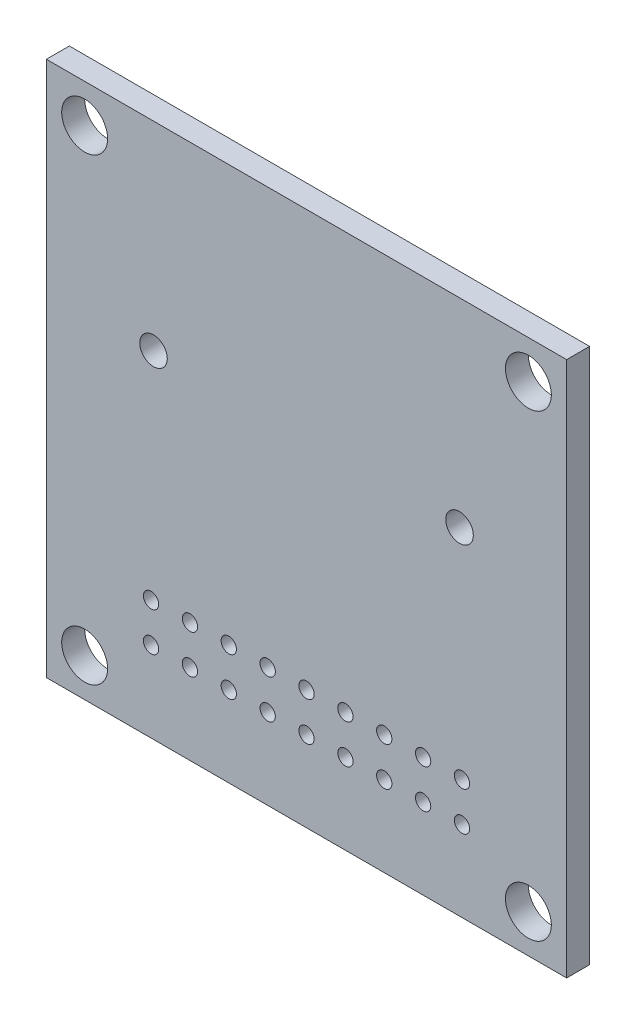
ISO-10303-21;
HEADER;
FILE_DESCRIPTION(('STEP AP214'),'2;1');
FILE_NAME('part.step','',(''),(''),'','','');
FILE_SCHEMA(('AUTOMOTIVE_DESIGN { 1 0 10303 214 1 1 1 1 }'));
ENDSEC;
DATA;
#1=APPLICATION_CONTEXT('core data for automotive mechanical design processes');
#2=APPLICATION_PROTOCOL_DEFINITION('international standard','automotive_design',2000,#1);
#3=PRODUCT_CONTEXT('',#1,'mechanical');
#4=PRODUCT('Part','Part','',(#3));
#5=PRODUCT_RELATED_PRODUCT_CATEGORY('part','',(#4));
#6=PRODUCT_DEFINITION_FORMATION('','',#4);
#7=PRODUCT_DEFINITION_CONTEXT('part definition',#1,'design');
#8=PRODUCT_DEFINITION('design','',#6,#7);
#9=PRODUCT_DEFINITION_SHAPE('','',#8);
#10=(LENGTH_UNIT() NAMED_UNIT(*) SI_UNIT(.MILLI.,.METRE.));
#11=(NAMED_UNIT(*) PLANE_ANGLE_UNIT() SI_UNIT($,.RADIAN.));
#12=(NAMED_UNIT(*) SI_UNIT($,.STERADIAN.) SOLID_ANGLE_UNIT());
#13=UNCERTAINTY_MEASURE_WITH_UNIT(LENGTH_MEASURE(1.E-05),#10,'distance_accuracy_value','');
#14=(GEOMETRIC_REPRESENTATION_CONTEXT(3) GLOBAL_UNCERTAINTY_ASSIGNED_CONTEXT((#13)) GLOBAL_UNIT_ASSIGNED_CONTEXT((#10,
#11,#12)) REPRESENTATION_CONTEXT('',''));
#15=CARTESIAN_POINT('',(0.,0.,0.));
#16=DIRECTION('',(0.,0.,1.));
#17=DIRECTION('',(1.,0.,0.));
#18=AXIS2_PLACEMENT_3D('',#15,#16,#17);
#19=CARTESIAN_POINT('',(0.,0.,1.5));
#20=DIRECTION('',(0.,0.,1.));
#21=DIRECTION('',(1.,0.,0.));
#22=AXIS2_PLACEMENT_3D('',#19,#20,#21);
#23=PLANE('',#22);
#24=CARTESIAN_POINT('',(-7.62,-9.69000000000001,1.5));
#25=DIRECTION('',(0.,0.,1.));
#26=DIRECTION('',(1.,0.,0.));
#27=AXIS2_PLACEMENT_3D('',#24,#25,#26);
#28=CIRCLE('',#27,0.500000000000001);
#29=CARTESIAN_POINT('',(-7.12,-9.69000000000001,1.5));
#30=VERTEX_POINT('',#29);
#31=EDGE_CURVE('E142',#30,#30,#28,.T.);
#32=ORIENTED_EDGE('',*,*,#31,.F.);
#33=EDGE_LOOP('',(#32));
#34=FACE_BOUND('',#33,.T.);
#35=CARTESIAN_POINT('',(-5.08,-12.23,1.5));
#36=DIRECTION('',(0.,0.,1.));
#37=DIRECTION('',(1.,0.,0.));
#38=AXIS2_PLACEMENT_3D('',#35,#36,#37);
#39=CIRCLE('',#38,0.500000000000002);
#40=CARTESIAN_POINT('',(-4.58,-12.23,1.5));
#41=VERTEX_POINT('',#40);
#42=EDGE_CURVE('E145',#41,#41,#39,.T.);
#43=ORIENTED_EDGE('',*,*,#42,.F.);
#44=EDGE_LOOP('',(#43));
#45=FACE_BOUND('',#44,.T.);
#46=CARTESIAN_POINT('',(-5.08,-9.69000000000001,1.5));
#47=DIRECTION('',(0.,0.,1.));
#48=DIRECTION('',(1.,0.,0.));
#49=AXIS2_PLACEMENT_3D('',#46,#47,#48);
#50=CIRCLE('',#49,0.500000000000002);
#51=CARTESIAN_POINT('',(-4.58,-9.69000000000001,1.5));
#52=VERTEX_POINT('',#51);
#53=EDGE_CURVE('E148',#52,#52,#50,.T.);
#54=ORIENTED_EDGE('',*,*,#53,.F.);
#55=EDGE_LOOP('',(#54));
#56=FACE_BOUND('',#55,.T.);
#57=CARTESIAN_POINT('',(-2.54,-12.23,1.5));
#58=DIRECTION('',(0.,0.,1.));
#59=DIRECTION('',(1.,0.,0.));
#60=AXIS2_PLACEMENT_3D('',#57,#58,#59);
#61=CIRCLE('',#60,0.500000000000001);
#62=CARTESIAN_POINT('',(-2.04,-12.23,1.5));
#63=VERTEX_POINT('',#62);
#64=EDGE_CURVE('E151',#63,#63,#61,.T.);
#65=ORIENTED_EDGE('',*,*,#64,.F.);
#66=EDGE_LOOP('',(#65));
#67=FACE_BOUND('',#66,.T.);
#68=CARTESIAN_POINT('',(-2.54,-9.69000000000001,1.5));
#69=DIRECTION('',(0.,0.,1.));
#70=DIRECTION('',(1.,0.,0.));
#71=AXIS2_PLACEMENT_3D('',#68,#69,#70);
#72=CIRCLE('',#71,0.500000000000001);
#73=CARTESIAN_POINT('',(-2.04,-9.69000000000001,1.5));
#74=VERTEX_POINT('',#73);
#75=EDGE_CURVE('E154',#74,#74,#72,.T.);
#76=ORIENTED_EDGE('',*,*,#75,.F.);
#77=EDGE_LOOP('',(#76));
#78=FACE_BOUND('',#77,.T.);
#79=CARTESIAN_POINT('',(-10.,4.5,1.5));
#80=DIRECTION('',(0.,0.,1.));
#81=DIRECTION('',(1.,0.,0.));
#82=AXIS2_PLACEMENT_3D('',#79,#80,#81);
#83=CIRCLE('',#82,0.9);
#84=CARTESIAN_POINT('',(-9.1,4.5,1.5));
#85=VERTEX_POINT('',#84);
#86=EDGE_CURVE('E157',#85,#85,#83,.T.);
#87=ORIENTED_EDGE('',*,*,#86,.F.);
#88=EDGE_LOOP('',(#87));
#89=FACE_BOUND('',#88,.T.);
#90=CARTESIAN_POINT('',(-10.16,-12.23,1.5));
#91=DIRECTION('',(0.,0.,1.));
#92=DIRECTION('',(1.,0.,0.));
#93=AXIS2_PLACEMENT_3D('',#90,#91,#92);
#94=CIRCLE('',#93,0.500000000000001);
#95=CARTESIAN_POINT('',(-9.66,-12.23,1.5));
#96=VERTEX_POINT('',#95);
#97=EDGE_CURVE('E160',#96,#96,#94,.T.);
#98=ORIENTED_EDGE('',*,*,#97,.F.);
#99=EDGE_LOOP('',(#98));
#100=FACE_BOUND('',#99,.T.);
#101=CARTESIAN_POINT('',(-10.16,-9.69000000000001,1.5));
#102=DIRECTION('',(0.,0.,1.));
#103=DIRECTION('',(1.,0.,0.));
#104=AXIS2_PLACEMENT_3D('',#101,#102,#103);
#105=CIRCLE('',#104,0.500000000000001);
#106=CARTESIAN_POINT('',(-9.66,-9.69000000000001,1.5));
#107=VERTEX_POINT('',#106);
#108=EDGE_CURVE('E163',#107,#107,#105,.T.);
#109=ORIENTED_EDGE('',*,*,#108,.F.);
#110=EDGE_LOOP('',(#109));
#111=FACE_BOUND('',#110,.T.);
#112=CARTESIAN_POINT('',(-7.62,-12.23,1.5));
#113=DIRECTION('',(0.,0.,1.));
#114=DIRECTION('',(1.,0.,0.));
#115=AXIS2_PLACEMENT_3D('',#112,#113,#114);
#116=CIRCLE('',#115,0.500000000000001);
#117=CARTESIAN_POINT('',(-7.12,-12.23,1.5));
#118=VERTEX_POINT('',#117);
#119=EDGE_CURVE('E166',#118,#118,#116,.T.);
#120=ORIENTED_EDGE('',*,*,#119,.F.);
#121=EDGE_LOOP('',(#120));
#122=FACE_BOUND('',#121,.T.);
#123=CARTESIAN_POINT('',(5.08,-9.69000000000001,1.5));
#124=DIRECTION('',(0.,0.,1.));
#125=DIRECTION('',(1.,0.,0.));
#126=AXIS2_PLACEMENT_3D('',#123,#124,#125);
#127=CIRCLE('',#126,0.500000000000001);
#128=CARTESIAN_POINT('',(5.58,-9.69000000000001,1.5));
#129=VERTEX_POINT('',#128);
#130=EDGE_CURVE('E169',#129,#129,#127,.T.);
#131=ORIENTED_EDGE('',*,*,#130,.F.);
#132=EDGE_LOOP('',(#131));
#133=FACE_BOUND('',#132,.T.);
#134=CARTESIAN_POINT('',(7.62,-12.23,1.5));
#135=DIRECTION('',(0.,0.,1.));
#136=DIRECTION('',(1.,0.,0.));
#137=AXIS2_PLACEMENT_3D('',#134,#135,#136);
#138=CIRCLE('',#137,0.500000000000001);
#139=CARTESIAN_POINT('',(8.12,-12.23,1.5));
#140=VERTEX_POINT('',#139);
#141=EDGE_CURVE('E172',#140,#140,#138,.T.);
#142=ORIENTED_EDGE('',*,*,#141,.F.);
#143=EDGE_LOOP('',(#142));
#144=FACE_BOUND('',#143,.T.);
#145=CARTESIAN_POINT('',(7.62,-9.69000000000001,1.5));
#146=DIRECTION('',(0.,0.,1.));
#147=DIRECTION('',(1.,0.,0.));
#148=AXIS2_PLACEMENT_3D('',#145,#146,#147);
#149=CIRCLE('',#148,0.500000000000001);
#150=CARTESIAN_POINT('',(8.12,-9.69000000000001,1.5));
#151=VERTEX_POINT('',#150);
#152=EDGE_CURVE('E175',#151,#151,#149,.T.);
#153=ORIENTED_EDGE('',*,*,#152,.F.);
#154=EDGE_LOOP('',(#153));
#155=FACE_BOUND('',#154,.T.);
#156=CARTESIAN_POINT('',(10.16,-12.23,1.5));
#157=DIRECTION('',(0.,0.,1.));
#158=DIRECTION('',(1.,0.,0.));
#159=AXIS2_PLACEMENT_3D('',#156,#157,#158);
#160=CIRCLE('',#159,0.500000000000001);
#161=CARTESIAN_POINT('',(10.66,-12.23,1.5));
#162=VERTEX_POINT('',#161);
#163=EDGE_CURVE('E178',#162,#162,#160,.T.);
#164=ORIENTED_EDGE('',*,*,#163,.F.);
#165=EDGE_LOOP('',(#164));
#166=FACE_BOUND('',#165,.T.);
#167=CARTESIAN_POINT('',(10.16,-9.69000000000001,1.5));
#168=DIRECTION('',(0.,0.,1.));
#169=DIRECTION('',(1.,0.,0.));
#170=AXIS2_PLACEMENT_3D('',#167,#168,#169);
#171=CIRCLE('',#170,0.500000000000001);
#172=CARTESIAN_POINT('',(10.66,-9.69000000000001,1.5));
#173=VERTEX_POINT('',#172);
#174=EDGE_CURVE('E181',#173,#173,#171,.T.);
#175=ORIENTED_EDGE('',*,*,#174,.F.);
#176=EDGE_LOOP('',(#175));
#177=FACE_BOUND('',#176,.T.);
#178=CARTESIAN_POINT('',(2.54,-12.23,1.5));
#179=DIRECTION('',(0.,0.,1.));
#180=DIRECTION('',(1.,0.,0.));
#181=AXIS2_PLACEMENT_3D('',#178,#179,#180);
#182=CIRCLE('',#181,0.500000000000001);
#183=CARTESIAN_POINT('',(3.04,-12.23,1.5));
#184=VERTEX_POINT('',#183);
#185=EDGE_CURVE('E184',#184,#184,#182,.T.);
#186=ORIENTED_EDGE('',*,*,#185,.F.);
#187=EDGE_LOOP('',(#186));
#188=FACE_BOUND('',#187,.T.);
#189=CARTESIAN_POINT('',(2.54,-9.69000000000001,1.5));
#190=DIRECTION('',(0.,0.,1.));
#191=DIRECTION('',(1.,0.,0.));
#192=AXIS2_PLACEMENT_3D('',#189,#190,#191);
#193=CIRCLE('',#192,0.500000000000001);
#194=CARTESIAN_POINT('',(3.04,-9.69000000000001,1.5));
#195=VERTEX_POINT('',#194);
#196=EDGE_CURVE('E187',#195,#195,#193,.T.);
#197=ORIENTED_EDGE('',*,*,#196,.F.);
#198=EDGE_LOOP('',(#197));
#199=FACE_BOUND('',#198,.T.);
#200=CARTESIAN_POINT('',(5.08,-12.23,1.5));
#201=DIRECTION('',(0.,0.,1.));
#202=DIRECTION('',(1.,0.,0.));
#203=AXIS2_PLACEMENT_3D('',#200,#201,#202);
#204=CIRCLE('',#203,0.500000000000001);
#205=CARTESIAN_POINT('',(5.58,-12.23,1.5));
#206=VERTEX_POINT('',#205);
#207=EDGE_CURVE('E190',#206,#206,#204,.T.);
#208=ORIENTED_EDGE('',*,*,#207,.F.);
#209=EDGE_LOOP('',(#208));
#210=FACE_BOUND('',#209,.T.);
#211=CARTESIAN_POINT('',(0.,-9.69000000000001,1.5));
#212=DIRECTION('',(0.,0.,1.));
#213=DIRECTION('',(1.,0.,0.));
#214=AXIS2_PLACEMENT_3D('',#211,#212,#213);
#215=CIRCLE('',#214,0.500000000000001);
#216=CARTESIAN_POINT('',(0.499999999999998,-9.69000000000001,1.5));
#217=VERTEX_POINT('',#216);
#218=EDGE_CURVE('E193',#217,#217,#215,.T.);
#219=ORIENTED_EDGE('',*,*,#218,.F.);
#220=EDGE_LOOP('',(#219));
#221=FACE_BOUND('',#220,.T.);
#222=CARTESIAN_POINT('',(0.,-12.23,1.5));
#223=DIRECTION('',(0.,0.,1.));
#224=DIRECTION('',(1.,0.,0.));
#225=AXIS2_PLACEMENT_3D('',#222,#223,#224);
#226=CIRCLE('',#225,0.500000000000001);
#227=CARTESIAN_POINT('',(0.499999999999998,-12.23,1.5));
#228=VERTEX_POINT('',#227);
#229=EDGE_CURVE('E196',#228,#228,#226,.T.);
#230=ORIENTED_EDGE('',*,*,#229,.F.);
#231=EDGE_LOOP('',(#230));
#232=FACE_BOUND('',#231,.T.);
#233=CARTESIAN_POINT('',(10.,4.5,1.5));
#234=DIRECTION('',(0.,0.,1.));
#235=DIRECTION('',(1.,0.,0.));
#236=AXIS2_PLACEMENT_3D('',#233,#234,#235);
#237=CIRCLE('',#236,0.9);
#238=CARTESIAN_POINT('',(10.9,4.5,1.5));
#239=VERTEX_POINT('',#238);
#240=EDGE_CURVE('E134',#239,#239,#237,.T.);
#241=ORIENTED_EDGE('',*,*,#240,.F.);
#242=EDGE_LOOP('',(#241));
#243=FACE_BOUND('',#242,.T.);
#244=CARTESIAN_POINT('',(14.5,-15.,1.5));
#245=DIRECTION('',(0.,0.,1.));
#246=DIRECTION('',(1.,0.,0.));
#247=AXIS2_PLACEMENT_3D('',#244,#245,#246);
#248=CIRCLE('',#247,1.5);
#249=CARTESIAN_POINT('',(16.,-15.,1.5));
#250=VERTEX_POINT('',#249);
#251=EDGE_CURVE('E122',#250,#250,#248,.T.);
#252=ORIENTED_EDGE('',*,*,#251,.F.);
#253=EDGE_LOOP('',(#252));
#254=FACE_BOUND('',#253,.T.);
#255=CARTESIAN_POINT('',(-14.5,15.,1.5));
#256=DIRECTION('',(0.,0.,1.));
#257=DIRECTION('',(1.,0.,0.));
#258=AXIS2_PLACEMENT_3D('',#255,#256,#257);
#259=CIRCLE('',#258,1.5);
#260=CARTESIAN_POINT('',(-13.,15.,1.5));
#261=VERTEX_POINT('',#260);
#262=EDGE_CURVE('E101',#261,#261,#259,.T.);
#263=ORIENTED_EDGE('',*,*,#262,.F.);
#264=EDGE_LOOP('',(#263));
#265=FACE_BOUND('',#264,.T.);
#266=DIRECTION('',(0.,-1.,0.));
#267=VECTOR('',#266,1.);
#268=CARTESIAN_POINT('',(-17.,-17.5,1.5));
#269=LINE('',#268,#267);
#270=CARTESIAN_POINT('',(-17.,17.5,1.5));
#271=VERTEX_POINT('',#270);
#272=CARTESIAN_POINT('',(-17.,-17.5,1.5));
#273=VERTEX_POINT('',#272);
#274=EDGE_CURVE('E86',#271,#273,#269,.T.);
#275=ORIENTED_EDGE('',*,*,#274,.T.);
#276=DIRECTION('',(1.,0.,0.));
#277=VECTOR('',#276,1.);
#278=CARTESIAN_POINT('',(17.,-17.5,1.5));
#279=LINE('',#278,#277);
#280=CARTESIAN_POINT('',(17.,-17.5,1.5));
#281=VERTEX_POINT('',#280);
#282=EDGE_CURVE('E81',#273,#281,#279,.T.);
#283=ORIENTED_EDGE('',*,*,#282,.T.);
#284=DIRECTION('',(0.,1.,0.));
#285=VECTOR('',#284,1.);
#286=CARTESIAN_POINT('',(17.,-17.5,1.5));
#287=LINE('',#286,#285);
#288=CARTESIAN_POINT('',(17.,17.5,1.5));
#289=VERTEX_POINT('',#288);
#290=EDGE_CURVE('E84',#281,#289,#287,.T.);
#291=ORIENTED_EDGE('',*,*,#290,.T.);
#292=DIRECTION('',(-1.,0.,0.));
#293=VECTOR('',#292,1.);
#294=CARTESIAN_POINT('',(17.,17.5,1.5));
#295=LINE('',#294,#293);
#296=EDGE_CURVE('E51',#289,#271,#295,.T.);
#297=ORIENTED_EDGE('',*,*,#296,.T.);
#298=EDGE_LOOP('',(#275,#283,#291,#297));
#299=FACE_BOUND('',#298,.T.);
#300=CARTESIAN_POINT('',(-14.5,-15.,1.5));
#301=DIRECTION('',(0.,0.,1.));
#302=DIRECTION('',(1.,0.,0.));
#303=AXIS2_PLACEMENT_3D('',#300,#301,#302);
#304=CIRCLE('',#303,1.5);
#305=CARTESIAN_POINT('',(-13.,-15.,1.5));
#306=VERTEX_POINT('',#305);
#307=EDGE_CURVE('E116',#306,#306,#304,.T.);
#308=ORIENTED_EDGE('',*,*,#307,.F.);
#309=EDGE_LOOP('',(#308));
#310=FACE_BOUND('',#309,.T.);
#311=CARTESIAN_POINT('',(14.5,15.,1.5));
#312=DIRECTION('',(0.,0.,1.));
#313=DIRECTION('',(1.,0.,0.));
#314=AXIS2_PLACEMENT_3D('',#311,#312,#313);
#315=CIRCLE('',#314,1.5);
#316=CARTESIAN_POINT('',(16.,15.,1.5));
#317=VERTEX_POINT('',#316);
#318=EDGE_CURVE('E128',#317,#317,#315,.T.);
#319=ORIENTED_EDGE('',*,*,#318,.F.);
#320=EDGE_LOOP('',(#319));
#321=FACE_BOUND('',#320,.T.);
#322=ADVANCED_FACE('F34',(#34,#45,#56,#67,#78,#89,#100,#111,#122,#133,#144,#155,#166,#177,#188,
#199,#210,#221,#232,#243,#254,#265,#299,#310,#321),#23,.T.);
#323=CARTESIAN_POINT('',(0.,0.,0.));
#324=DIRECTION('',(0.,0.,1.));
#325=DIRECTION('',(1.,0.,0.));
#326=AXIS2_PLACEMENT_3D('',#323,#324,#325);
#327=PLANE('',#326);
#328=CARTESIAN_POINT('',(-7.62,-9.69000000000001,0.));
#329=DIRECTION('',(0.,0.,-1.));
#330=DIRECTION('',(-1.,0.,0.));
#331=AXIS2_PLACEMENT_3D('',#328,#329,#330);
#332=CIRCLE('',#331,0.500000000000001);
#333=CARTESIAN_POINT('',(-8.12,-9.69000000000001,0.));
#334=VERTEX_POINT('',#333);
#335=EDGE_CURVE('E240',#334,#334,#332,.T.);
#336=ORIENTED_EDGE('',*,*,#335,.F.);
#337=EDGE_LOOP('',(#336));
#338=FACE_BOUND('',#337,.T.);
#339=CARTESIAN_POINT('',(-5.08,-12.23,0.));
#340=DIRECTION('',(0.,0.,-1.));
#341=DIRECTION('',(-1.,0.,0.));
#342=AXIS2_PLACEMENT_3D('',#339,#340,#341);
#343=CIRCLE('',#342,0.500000000000002);
#344=CARTESIAN_POINT('',(-5.58000000000001,-12.23,0.));
#345=VERTEX_POINT('',#344);
#346=EDGE_CURVE('E243',#345,#345,#343,.T.);
#347=ORIENTED_EDGE('',*,*,#346,.F.);
#348=EDGE_LOOP('',(#347));
#349=FACE_BOUND('',#348,.T.);
#350=CARTESIAN_POINT('',(-5.08,-9.69000000000001,0.));
#351=DIRECTION('',(0.,0.,-1.));
#352=DIRECTION('',(-1.,0.,0.));
#353=AXIS2_PLACEMENT_3D('',#350,#351,#352);
#354=CIRCLE('',#353,0.500000000000002);
#355=CARTESIAN_POINT('',(-5.58000000000001,-9.69000000000001,0.));
#356=VERTEX_POINT('',#355);
#357=EDGE_CURVE('E246',#356,#356,#354,.T.);
#358=ORIENTED_EDGE('',*,*,#357,.F.);
#359=EDGE_LOOP('',(#358));
#360=FACE_BOUND('',#359,.T.);
#361=CARTESIAN_POINT('',(-2.54,-12.23,0.));
#362=DIRECTION('',(0.,0.,-1.));
#363=DIRECTION('',(-1.,0.,0.));
#364=AXIS2_PLACEMENT_3D('',#361,#362,#363);
#365=CIRCLE('',#364,0.500000000000001);
#366=CARTESIAN_POINT('',(-3.04,-12.23,0.));
#367=VERTEX_POINT('',#366);
#368=EDGE_CURVE('E251',#367,#367,#365,.T.);
#369=ORIENTED_EDGE('',*,*,#368,.F.);
#370=EDGE_LOOP('',(#369));
#371=FACE_BOUND('',#370,.T.);
#372=CARTESIAN_POINT('',(-2.54,-9.69000000000001,0.));
#373=DIRECTION('',(0.,0.,-1.));
#374=DIRECTION('',(-1.,0.,0.));
#375=AXIS2_PLACEMENT_3D('',#372,#373,#374);
#376=CIRCLE('',#375,0.500000000000001);
#377=CARTESIAN_POINT('',(-3.04,-9.69000000000001,0.));
#378=VERTEX_POINT('',#377);
#379=EDGE_CURVE('E216',#378,#378,#376,.T.);
#380=ORIENTED_EDGE('',*,*,#379,.F.);
#381=EDGE_LOOP('',(#380));
#382=FACE_BOUND('',#381,.T.);
#383=CARTESIAN_POINT('',(-10.,4.5,0.));
#384=DIRECTION('',(0.,0.,-1.));
#385=DIRECTION('',(-1.,0.,0.));
#386=AXIS2_PLACEMENT_3D('',#383,#384,#385);
#387=CIRCLE('',#386,0.9);
#388=CARTESIAN_POINT('',(-10.9,4.5,0.));
#389=VERTEX_POINT('',#388);
#390=EDGE_CURVE('E199',#389,#389,#387,.T.);
#391=ORIENTED_EDGE('',*,*,#390,.F.);
#392=EDGE_LOOP('',(#391));
#393=FACE_BOUND('',#392,.T.);
#394=CARTESIAN_POINT('',(-10.16,-12.23,0.));
#395=DIRECTION('',(0.,0.,-1.));
#396=DIRECTION('',(-1.,0.,0.));
#397=AXIS2_PLACEMENT_3D('',#394,#395,#396);
#398=CIRCLE('',#397,0.500000000000001);
#399=CARTESIAN_POINT('',(-10.66,-12.23,0.));
#400=VERTEX_POINT('',#399);
#401=EDGE_CURVE('E231',#400,#400,#398,.T.);
#402=ORIENTED_EDGE('',*,*,#401,.F.);
#403=EDGE_LOOP('',(#402));
#404=FACE_BOUND('',#403,.T.);
#405=CARTESIAN_POINT('',(-10.16,-9.69000000000001,0.));
#406=DIRECTION('',(0.,0.,-1.));
#407=DIRECTION('',(-1.,0.,0.));
#408=AXIS2_PLACEMENT_3D('',#405,#406,#407);
#409=CIRCLE('',#408,0.500000000000001);
#410=CARTESIAN_POINT('',(-10.66,-9.69000000000001,0.));
#411=VERTEX_POINT('',#410);
#412=EDGE_CURVE('E234',#411,#411,#409,.T.);
#413=ORIENTED_EDGE('',*,*,#412,.F.);
#414=EDGE_LOOP('',(#413));
#415=FACE_BOUND('',#414,.T.);
#416=CARTESIAN_POINT('',(-7.62,-12.23,0.));
#417=DIRECTION('',(0.,0.,-1.));
#418=DIRECTION('',(-1.,0.,0.));
#419=AXIS2_PLACEMENT_3D('',#416,#417,#418);
#420=CIRCLE('',#419,0.500000000000001);
#421=CARTESIAN_POINT('',(-8.12,-12.23,0.));
#422=VERTEX_POINT('',#421);
#423=EDGE_CURVE('E237',#422,#422,#420,.T.);
#424=ORIENTED_EDGE('',*,*,#423,.F.);
#425=EDGE_LOOP('',(#424));
#426=FACE_BOUND('',#425,.T.);
#427=CARTESIAN_POINT('',(5.08,-9.69000000000001,0.));
#428=DIRECTION('',(0.,0.,-1.));
#429=DIRECTION('',(-1.,0.,0.));
#430=AXIS2_PLACEMENT_3D('',#427,#428,#429);
#431=CIRCLE('',#430,0.500000000000001);
#432=CARTESIAN_POINT('',(4.58,-9.69000000000001,0.));
#433=VERTEX_POINT('',#432);
#434=EDGE_CURVE('E208',#433,#433,#431,.T.);
#435=ORIENTED_EDGE('',*,*,#434,.F.);
#436=EDGE_LOOP('',(#435));
#437=FACE_BOUND('',#436,.T.);
#438=CARTESIAN_POINT('',(7.62,-12.23,0.));
#439=DIRECTION('',(0.,0.,-1.));
#440=DIRECTION('',(-1.,0.,0.));
#441=AXIS2_PLACEMENT_3D('',#438,#439,#440);
#442=CIRCLE('',#441,0.500000000000001);
#443=CARTESIAN_POINT('',(7.12,-12.23,0.));
#444=VERTEX_POINT('',#443);
#445=EDGE_CURVE('E217',#444,#444,#442,.T.);
#446=ORIENTED_EDGE('',*,*,#445,.F.);
#447=EDGE_LOOP('',(#446));
#448=FACE_BOUND('',#447,.T.);
#449=CARTESIAN_POINT('',(7.62,-9.69000000000001,0.));
#450=DIRECTION('',(0.,0.,-1.));
#451=DIRECTION('',(-1.,0.,0.));
#452=AXIS2_PLACEMENT_3D('',#449,#450,#451);
#453=CIRCLE('',#452,0.500000000000001);
#454=CARTESIAN_POINT('',(7.12,-9.69000000000001,0.));
#455=VERTEX_POINT('',#454);
#456=EDGE_CURVE('E220',#455,#455,#453,.T.);
#457=ORIENTED_EDGE('',*,*,#456,.F.);
#458=EDGE_LOOP('',(#457));
#459=FACE_BOUND('',#458,.T.);
#460=CARTESIAN_POINT('',(10.16,-12.23,0.));
#461=DIRECTION('',(0.,0.,-1.));
#462=DIRECTION('',(-1.,0.,0.));
#463=AXIS2_PLACEMENT_3D('',#460,#461,#462);
#464=CIRCLE('',#463,0.500000000000001);
#465=CARTESIAN_POINT('',(9.66,-12.23,0.));
#466=VERTEX_POINT('',#465);
#467=EDGE_CURVE('E226',#466,#466,#464,.T.);
#468=ORIENTED_EDGE('',*,*,#467,.F.);
#469=EDGE_LOOP('',(#468));
#470=FACE_BOUND('',#469,.T.);
#471=CARTESIAN_POINT('',(10.16,-9.69000000000001,0.));
#472=DIRECTION('',(0.,0.,-1.));
#473=DIRECTION('',(-1.,0.,0.));
#474=AXIS2_PLACEMENT_3D('',#471,#472,#473);
#475=CIRCLE('',#474,0.500000000000001);
#476=CARTESIAN_POINT('',(9.66,-9.69000000000001,0.));
#477=VERTEX_POINT('',#476);
#478=EDGE_CURVE('E223',#477,#477,#475,.T.);
#479=ORIENTED_EDGE('',*,*,#478,.F.);
#480=EDGE_LOOP('',(#479));
#481=FACE_BOUND('',#480,.T.);
#482=CARTESIAN_POINT('',(2.54,-12.23,0.));
#483=DIRECTION('',(0.,0.,-1.));
#484=DIRECTION('',(-1.,0.,0.));
#485=AXIS2_PLACEMENT_3D('',#482,#483,#484);
#486=CIRCLE('',#485,0.500000000000001);
#487=CARTESIAN_POINT('',(2.04,-12.23,0.));
#488=VERTEX_POINT('',#487);
#489=EDGE_CURVE('E200',#488,#488,#486,.T.);
#490=ORIENTED_EDGE('',*,*,#489,.F.);
#491=EDGE_LOOP('',(#490));
#492=FACE_BOUND('',#491,.T.);
#493=CARTESIAN_POINT('',(2.54,-9.69000000000001,0.));
#494=DIRECTION('',(0.,0.,-1.));
#495=DIRECTION('',(-1.,0.,0.));
#496=AXIS2_PLACEMENT_3D('',#493,#494,#495);
#497=CIRCLE('',#496,0.500000000000001);
#498=CARTESIAN_POINT('',(2.04,-9.69000000000001,0.));
#499=VERTEX_POINT('',#498);
#500=EDGE_CURVE('E204',#499,#499,#497,.T.);
#501=ORIENTED_EDGE('',*,*,#500,.F.);
#502=EDGE_LOOP('',(#501));
#503=FACE_BOUND('',#502,.T.);
#504=CARTESIAN_POINT('',(5.08,-12.23,0.));
#505=DIRECTION('',(0.,0.,-1.));
#506=DIRECTION('',(-1.,0.,0.));
#507=AXIS2_PLACEMENT_3D('',#504,#505,#506);
#508=CIRCLE('',#507,0.500000000000001);
#509=CARTESIAN_POINT('',(4.58,-12.23,0.));
#510=VERTEX_POINT('',#509);
#511=EDGE_CURVE('E205',#510,#510,#508,.T.);
#512=ORIENTED_EDGE('',*,*,#511,.F.);
#513=EDGE_LOOP('',(#512));
#514=FACE_BOUND('',#513,.T.);
#515=CARTESIAN_POINT('',(0.,-9.69000000000001,0.));
#516=DIRECTION('',(0.,0.,-1.));
#517=DIRECTION('',(-1.,0.,0.));
#518=AXIS2_PLACEMENT_3D('',#515,#516,#517);
#519=CIRCLE('',#518,0.500000000000001);
#520=CARTESIAN_POINT('',(-0.500000000000004,-9.69000000000001,0.));
#521=VERTEX_POINT('',#520);
#522=EDGE_CURVE('E203',#521,#521,#519,.T.);
#523=ORIENTED_EDGE('',*,*,#522,.F.);
#524=EDGE_LOOP('',(#523));
#525=FACE_BOUND('',#524,.T.);
#526=CARTESIAN_POINT('',(0.,-12.23,0.));
#527=DIRECTION('',(0.,0.,-1.));
#528=DIRECTION('',(-1.,0.,0.));
#529=AXIS2_PLACEMENT_3D('',#526,#527,#528);
#530=CIRCLE('',#529,0.500000000000001);
#531=CARTESIAN_POINT('',(-0.500000000000004,-12.23,0.));
#532=VERTEX_POINT('',#531);
#533=EDGE_CURVE('E213',#532,#532,#530,.T.);
#534=ORIENTED_EDGE('',*,*,#533,.F.);
#535=EDGE_LOOP('',(#534));
#536=FACE_BOUND('',#535,.T.);
#537=CARTESIAN_POINT('',(10.,4.5,0.));
#538=DIRECTION('',(0.,0.,-1.));
#539=DIRECTION('',(-1.,0.,0.));
#540=AXIS2_PLACEMENT_3D('',#537,#538,#539);
#541=CIRCLE('',#540,0.9);
#542=CARTESIAN_POINT('',(9.1,4.5,0.));
#543=VERTEX_POINT('',#542);
#544=EDGE_CURVE('E139',#543,#543,#541,.T.);
#545=ORIENTED_EDGE('',*,*,#544,.F.);
#546=EDGE_LOOP('',(#545));
#547=FACE_BOUND('',#546,.T.);
#548=DIRECTION('',(0.,-1.,0.));
#549=VECTOR('',#548,1.);
#550=CARTESIAN_POINT('',(-17.,-17.5,0.));
#551=LINE('',#550,#549);
#552=CARTESIAN_POINT('',(-17.,17.5,0.));
#553=VERTEX_POINT('',#552);
#554=CARTESIAN_POINT('',(-17.,-17.5,0.));
#555=VERTEX_POINT('',#554);
#556=EDGE_CURVE('E98',#553,#555,#551,.T.);
#557=ORIENTED_EDGE('',*,*,#556,.F.);
#558=DIRECTION('',(-1.,0.,0.));
#559=VECTOR('',#558,1.);
#560=CARTESIAN_POINT('',(17.,17.5,0.));
#561=LINE('',#560,#559);
#562=CARTESIAN_POINT('',(17.,17.5,0.));
#563=VERTEX_POINT('',#562);
#564=EDGE_CURVE('E74',#563,#553,#561,.T.);
#565=ORIENTED_EDGE('',*,*,#564,.F.);
#566=DIRECTION('',(0.,1.,0.));
#567=VECTOR('',#566,1.);
#568=CARTESIAN_POINT('',(17.,-17.5,0.));
#569=LINE('',#568,#567);
#570=CARTESIAN_POINT('',(17.,-17.5,0.));
#571=VERTEX_POINT('',#570);
#572=EDGE_CURVE('E68',#571,#563,#569,.T.);
#573=ORIENTED_EDGE('',*,*,#572,.F.);
#574=DIRECTION('',(1.,0.,0.));
#575=VECTOR('',#574,1.);
#576=CARTESIAN_POINT('',(17.,-17.5,0.));
#577=LINE('',#576,#575);
#578=EDGE_CURVE('E90',#555,#571,#577,.T.);
#579=ORIENTED_EDGE('',*,*,#578,.F.);
#580=EDGE_LOOP('',(#557,#565,#573,#579));
#581=FACE_BOUND('',#580,.T.);
#582=CARTESIAN_POINT('',(-14.5,15.,0.));
#583=DIRECTION('',(0.,0.,1.));
#584=DIRECTION('',(1.,0.,0.));
#585=AXIS2_PLACEMENT_3D('',#582,#583,#584);
#586=CIRCLE('',#585,1.5);
#587=CARTESIAN_POINT('',(-13.,15.,0.));
#588=VERTEX_POINT('',#587);
#589=EDGE_CURVE('E113',#588,#588,#586,.T.);
#590=ORIENTED_EDGE('',*,*,#589,.T.);
#591=EDGE_LOOP('',(#590));
#592=FACE_BOUND('',#591,.T.);
#593=CARTESIAN_POINT('',(-14.5,-15.,0.));
#594=DIRECTION('',(0.,0.,1.));
#595=DIRECTION('',(1.,0.,0.));
#596=AXIS2_PLACEMENT_3D('',#593,#594,#595);
#597=CIRCLE('',#596,1.5);
#598=CARTESIAN_POINT('',(-13.,-15.,0.));
#599=VERTEX_POINT('',#598);
#600=EDGE_CURVE('E119',#599,#599,#597,.T.);
#601=ORIENTED_EDGE('',*,*,#600,.T.);
#602=EDGE_LOOP('',(#601));
#603=FACE_BOUND('',#602,.T.);
#604=CARTESIAN_POINT('',(14.5,-15.,0.));
#605=DIRECTION('',(0.,0.,1.));
#606=DIRECTION('',(1.,0.,0.));
#607=AXIS2_PLACEMENT_3D('',#604,#605,#606);
#608=CIRCLE('',#607,1.5);
#609=CARTESIAN_POINT('',(16.,-15.,0.));
#610=VERTEX_POINT('',#609);
#611=EDGE_CURVE('E125',#610,#610,#608,.T.);
#612=ORIENTED_EDGE('',*,*,#611,.T.);
#613=EDGE_LOOP('',(#612));
#614=FACE_BOUND('',#613,.T.);
#615=CARTESIAN_POINT('',(14.5,15.,0.));
#616=DIRECTION('',(0.,0.,1.));
#617=DIRECTION('',(1.,0.,0.));
#618=AXIS2_PLACEMENT_3D('',#615,#616,#617);
#619=CIRCLE('',#618,1.5);
#620=CARTESIAN_POINT('',(16.,15.,0.));
#621=VERTEX_POINT('',#620);
#622=EDGE_CURVE('E131',#621,#621,#619,.T.);
#623=ORIENTED_EDGE('',*,*,#622,.T.);
#624=EDGE_LOOP('',(#623));
#625=FACE_BOUND('',#624,.T.);
#626=ADVANCED_FACE('F109',(#338,#349,#360,#371,#382,#393,#404,#415,#426,#437,#448,#459,#470,
#481,#492,#503,#514,#525,#536,#547,#581,#592,#603,#614,#625),#327,.F.);
#627=CARTESIAN_POINT('',(-17.,-17.5,1.5));
#628=DIRECTION('',(1.,0.,0.));
#629=DIRECTION('',(0.,0.,-1.));
#630=AXIS2_PLACEMENT_3D('',#627,#628,#629);
#631=PLANE('',#630);
#632=ORIENTED_EDGE('',*,*,#556,.T.);
#633=DIRECTION('',(0.,0.,-1.));
#634=VECTOR('',#633,1.);
#635=CARTESIAN_POINT('',(-17.,-17.5,1.5));
#636=LINE('',#635,#634);
#637=EDGE_CURVE('E11',#273,#555,#636,.T.);
#638=ORIENTED_EDGE('',*,*,#637,.F.);
#639=ORIENTED_EDGE('',*,*,#274,.F.);
#640=DIRECTION('',(0.,0.,-1.));
#641=VECTOR('',#640,1.);
#642=CARTESIAN_POINT('',(-17.,17.5,1.5));
#643=LINE('',#642,#641);
#644=EDGE_CURVE('E94',#271,#553,#643,.T.);
#645=ORIENTED_EDGE('',*,*,#644,.T.);
#646=EDGE_LOOP('',(#632,#638,#639,#645));
#647=FACE_BOUND('',#646,.T.);
#648=ADVANCED_FACE('F36',(#647),#631,.F.);
#649=CARTESIAN_POINT('',(17.,-17.5,1.5));
#650=DIRECTION('',(0.,1.,0.));
#651=DIRECTION('',(-1.,0.,0.));
#652=AXIS2_PLACEMENT_3D('',#649,#650,#651);
#653=PLANE('',#652);
#654=ORIENTED_EDGE('',*,*,#578,.T.);
#655=DIRECTION('',(0.,0.,-1.));
#656=VECTOR('',#655,1.);
#657=CARTESIAN_POINT('',(17.,-17.5,1.5));
#658=LINE('',#657,#656);
#659=EDGE_CURVE('E43',#281,#571,#658,.T.);
#660=ORIENTED_EDGE('',*,*,#659,.F.);
#661=ORIENTED_EDGE('',*,*,#282,.F.);
#662=ORIENTED_EDGE('',*,*,#637,.T.);
#663=EDGE_LOOP('',(#654,#660,#661,#662));
#664=FACE_BOUND('',#663,.T.);
#665=ADVANCED_FACE('F89',(#664),#653,.F.);
#666=CARTESIAN_POINT('',(17.,-17.5,1.5));
#667=DIRECTION('',(-1.,0.,0.));
#668=DIRECTION('',(0.,0.,1.));
#669=AXIS2_PLACEMENT_3D('',#666,#667,#668);
#670=PLANE('',#669);
#671=ORIENTED_EDGE('',*,*,#572,.T.);
#672=DIRECTION('',(0.,0.,-1.));
#673=VECTOR('',#672,1.);
#674=CARTESIAN_POINT('',(17.,17.5,1.5));
#675=LINE('',#674,#673);
#676=EDGE_CURVE('E91',#289,#563,#675,.T.);
#677=ORIENTED_EDGE('',*,*,#676,.F.);
#678=ORIENTED_EDGE('',*,*,#290,.F.);
#679=ORIENTED_EDGE('',*,*,#659,.T.);
#680=EDGE_LOOP('',(#671,#677,#678,#679));
#681=FACE_BOUND('',#680,.T.);
#682=ADVANCED_FACE('F92',(#681),#670,.F.);
#683=CARTESIAN_POINT('',(17.,17.5,1.5));
#684=DIRECTION('',(0.,-1.,0.));
#685=DIRECTION('',(1.,0.,0.));
#686=AXIS2_PLACEMENT_3D('',#683,#684,#685);
#687=PLANE('',#686);
#688=ORIENTED_EDGE('',*,*,#564,.T.);
#689=ORIENTED_EDGE('',*,*,#644,.F.);
#690=ORIENTED_EDGE('',*,*,#296,.F.);
#691=ORIENTED_EDGE('',*,*,#676,.T.);
#692=EDGE_LOOP('',(#688,#689,#690,#691));
#693=FACE_BOUND('',#692,.T.);
#694=ADVANCED_FACE('F106',(#693),#687,.F.);
#695=CARTESIAN_POINT('',(-14.5,15.,1.5));
#696=DIRECTION('',(0.,0.,-1.));
#697=DIRECTION('',(-1.,0.,0.));
#698=AXIS2_PLACEMENT_3D('',#695,#696,#697);
#699=CYLINDRICAL_SURFACE('',#698,1.5);
#700=ORIENTED_EDGE('',*,*,#262,.T.);
#701=EDGE_LOOP('',(#700));
#702=FACE_BOUND('',#701,.T.);
#703=ORIENTED_EDGE('',*,*,#589,.F.);
#704=EDGE_LOOP('',(#703));
#705=FACE_BOUND('',#704,.T.);
#706=ADVANCED_FACE('F322',(#702,#705),#699,.F.);
#707=CARTESIAN_POINT('',(-14.5,-15.,1.5));
#708=DIRECTION('',(0.,0.,-1.));
#709=DIRECTION('',(-1.,0.,0.));
#710=AXIS2_PLACEMENT_3D('',#707,#708,#709);
#711=CYLINDRICAL_SURFACE('',#710,1.5);
#712=ORIENTED_EDGE('',*,*,#307,.T.);
#713=EDGE_LOOP('',(#712));
#714=FACE_BOUND('',#713,.T.);
#715=ORIENTED_EDGE('',*,*,#600,.F.);
#716=EDGE_LOOP('',(#715));
#717=FACE_BOUND('',#716,.T.);
#718=ADVANCED_FACE('F582',(#714,#717),#711,.F.);
#719=CARTESIAN_POINT('',(14.5,-15.,1.5));
#720=DIRECTION('',(0.,0.,-1.));
#721=DIRECTION('',(-1.,0.,0.));
#722=AXIS2_PLACEMENT_3D('',#719,#720,#721);
#723=CYLINDRICAL_SURFACE('',#722,1.5);
#724=ORIENTED_EDGE('',*,*,#251,.T.);
#725=EDGE_LOOP('',(#724));
#726=FACE_BOUND('',#725,.T.);
#727=ORIENTED_EDGE('',*,*,#611,.F.);
#728=EDGE_LOOP('',(#727));
#729=FACE_BOUND('',#728,.T.);
#730=ADVANCED_FACE('F310',(#726,#729),#723,.F.);
#731=CARTESIAN_POINT('',(14.5,15.,1.5));
#732=DIRECTION('',(0.,0.,-1.));
#733=DIRECTION('',(-1.,0.,0.));
#734=AXIS2_PLACEMENT_3D('',#731,#732,#733);
#735=CYLINDRICAL_SURFACE('',#734,1.5);
#736=ORIENTED_EDGE('',*,*,#318,.T.);
#737=EDGE_LOOP('',(#736));
#738=FACE_BOUND('',#737,.T.);
#739=ORIENTED_EDGE('',*,*,#622,.F.);
#740=EDGE_LOOP('',(#739));
#741=FACE_BOUND('',#740,.T.);
#742=ADVANCED_FACE('F300',(#738,#741),#735,.F.);
#743=CARTESIAN_POINT('',(10.,4.5,2.));
#744=DIRECTION('',(0.,0.,-1.));
#745=DIRECTION('',(-1.,0.,0.));
#746=AXIS2_PLACEMENT_3D('',#743,#744,#745);
#747=CYLINDRICAL_SURFACE('',#746,0.9);
#748=ORIENTED_EDGE('',*,*,#240,.T.);
#749=EDGE_LOOP('',(#748));
#750=FACE_BOUND('',#749,.T.);
#751=ORIENTED_EDGE('',*,*,#544,.T.);
#752=EDGE_LOOP('',(#751));
#753=FACE_BOUND('',#752,.T.);
#754=ADVANCED_FACE('F297',(#750,#753),#747,.F.);
#755=CARTESIAN_POINT('',(0.,-12.23,2.));
#756=DIRECTION('',(0.,0.,-1.));
#757=DIRECTION('',(-1.,0.,0.));
#758=AXIS2_PLACEMENT_3D('',#755,#756,#757);
#759=CYLINDRICAL_SURFACE('',#758,0.500000000000001);
#760=ORIENTED_EDGE('',*,*,#229,.T.);
#761=EDGE_LOOP('',(#760));
#762=FACE_BOUND('',#761,.T.);
#763=ORIENTED_EDGE('',*,*,#533,.T.);
#764=EDGE_LOOP('',(#763));
#765=FACE_BOUND('',#764,.T.);
#766=ADVANCED_FACE('F299',(#762,#765),#759,.F.);
#767=CARTESIAN_POINT('',(0.,-9.69000000000001,2.));
#768=DIRECTION('',(0.,0.,-1.));
#769=DIRECTION('',(-1.,0.,0.));
#770=AXIS2_PLACEMENT_3D('',#767,#768,#769);
#771=CYLINDRICAL_SURFACE('',#770,0.500000000000001);
#772=ORIENTED_EDGE('',*,*,#218,.T.);
#773=EDGE_LOOP('',(#772));
#774=FACE_BOUND('',#773,.T.);
#775=ORIENTED_EDGE('',*,*,#522,.T.);
#776=EDGE_LOOP('',(#775));
#777=FACE_BOUND('',#776,.T.);
#778=ADVANCED_FACE('F307',(#774,#777),#771,.F.);
#779=CARTESIAN_POINT('',(5.08,-12.23,2.));
#780=DIRECTION('',(0.,0.,-1.));
#781=DIRECTION('',(-1.,0.,0.));
#782=AXIS2_PLACEMENT_3D('',#779,#780,#781);
#783=CYLINDRICAL_SURFACE('',#782,0.500000000000001);
#784=ORIENTED_EDGE('',*,*,#207,.T.);
#785=EDGE_LOOP('',(#784));
#786=FACE_BOUND('',#785,.T.);
#787=ORIENTED_EDGE('',*,*,#511,.T.);
#788=EDGE_LOOP('',(#787));
#789=FACE_BOUND('',#788,.T.);
#790=ADVANCED_FACE('F361',(#786,#789),#783,.F.);
#791=CARTESIAN_POINT('',(2.54,-9.69000000000001,2.));
#792=DIRECTION('',(0.,0.,-1.));
#793=DIRECTION('',(-1.,0.,0.));
#794=AXIS2_PLACEMENT_3D('',#791,#792,#793);
#795=CYLINDRICAL_SURFACE('',#794,0.500000000000001);
#796=ORIENTED_EDGE('',*,*,#196,.T.);
#797=EDGE_LOOP('',(#796));
#798=FACE_BOUND('',#797,.T.);
#799=ORIENTED_EDGE('',*,*,#500,.T.);
#800=EDGE_LOOP('',(#799));
#801=FACE_BOUND('',#800,.T.);
#802=ADVANCED_FACE('F371',(#798,#801),#795,.F.);
#803=CARTESIAN_POINT('',(2.54,-12.23,2.));
#804=DIRECTION('',(0.,0.,-1.));
#805=DIRECTION('',(-1.,0.,0.));
#806=AXIS2_PLACEMENT_3D('',#803,#804,#805);
#807=CYLINDRICAL_SURFACE('',#806,0.500000000000001);
#808=ORIENTED_EDGE('',*,*,#185,.T.);
#809=EDGE_LOOP('',(#808));
#810=FACE_BOUND('',#809,.T.);
#811=ORIENTED_EDGE('',*,*,#489,.T.);
#812=EDGE_LOOP('',(#811));
#813=FACE_BOUND('',#812,.T.);
#814=ADVANCED_FACE('F381',(#810,#813),#807,.F.);
#815=CARTESIAN_POINT('',(10.16,-9.69000000000001,2.));
#816=DIRECTION('',(0.,0.,-1.));
#817=DIRECTION('',(-1.,0.,0.));
#818=AXIS2_PLACEMENT_3D('',#815,#816,#817);
#819=CYLINDRICAL_SURFACE('',#818,0.500000000000001);
#820=ORIENTED_EDGE('',*,*,#174,.T.);
#821=EDGE_LOOP('',(#820));
#822=FACE_BOUND('',#821,.T.);
#823=ORIENTED_EDGE('',*,*,#478,.T.);
#824=EDGE_LOOP('',(#823));
#825=FACE_BOUND('',#824,.T.);
#826=ADVANCED_FACE('F391',(#822,#825),#819,.F.);
#827=CARTESIAN_POINT('',(10.16,-12.23,2.));
#828=DIRECTION('',(0.,0.,-1.));
#829=DIRECTION('',(-1.,0.,0.));
#830=AXIS2_PLACEMENT_3D('',#827,#828,#829);
#831=CYLINDRICAL_SURFACE('',#830,0.500000000000001);
#832=ORIENTED_EDGE('',*,*,#163,.T.);
#833=EDGE_LOOP('',(#832));
#834=FACE_BOUND('',#833,.T.);
#835=ORIENTED_EDGE('',*,*,#467,.T.);
#836=EDGE_LOOP('',(#835));
#837=FACE_BOUND('',#836,.T.);
#838=ADVANCED_FACE('F400',(#834,#837),#831,.F.);
#839=CARTESIAN_POINT('',(7.62,-9.69000000000001,2.));
#840=DIRECTION('',(0.,0.,-1.));
#841=DIRECTION('',(-1.,0.,0.));
#842=AXIS2_PLACEMENT_3D('',#839,#840,#841);
#843=CYLINDRICAL_SURFACE('',#842,0.500000000000001);
#844=ORIENTED_EDGE('',*,*,#152,.T.);
#845=EDGE_LOOP('',(#844));
#846=FACE_BOUND('',#845,.T.);
#847=ORIENTED_EDGE('',*,*,#456,.T.);
#848=EDGE_LOOP('',(#847));
#849=FACE_BOUND('',#848,.T.);
#850=ADVANCED_FACE('F410',(#846,#849),#843,.F.);
#851=CARTESIAN_POINT('',(7.62,-12.23,2.));
#852=DIRECTION('',(0.,0.,-1.));
#853=DIRECTION('',(-1.,0.,0.));
#854=AXIS2_PLACEMENT_3D('',#851,#852,#853);
#855=CYLINDRICAL_SURFACE('',#854,0.500000000000001);
#856=ORIENTED_EDGE('',*,*,#141,.T.);
#857=EDGE_LOOP('',(#856));
#858=FACE_BOUND('',#857,.T.);
#859=ORIENTED_EDGE('',*,*,#445,.T.);
#860=EDGE_LOOP('',(#859));
#861=FACE_BOUND('',#860,.T.);
#862=ADVANCED_FACE('F420',(#858,#861),#855,.F.);
#863=CARTESIAN_POINT('',(5.08,-9.69000000000001,2.));
#864=DIRECTION('',(0.,0.,-1.));
#865=DIRECTION('',(-1.,0.,0.));
#866=AXIS2_PLACEMENT_3D('',#863,#864,#865);
#867=CYLINDRICAL_SURFACE('',#866,0.500000000000001);
#868=ORIENTED_EDGE('',*,*,#130,.T.);
#869=EDGE_LOOP('',(#868));
#870=FACE_BOUND('',#869,.T.);
#871=ORIENTED_EDGE('',*,*,#434,.T.);
#872=EDGE_LOOP('',(#871));
#873=FACE_BOUND('',#872,.T.);
#874=ADVANCED_FACE('F430',(#870,#873),#867,.F.);
#875=CARTESIAN_POINT('',(-7.62,-12.23,2.));
#876=DIRECTION('',(0.,0.,-1.));
#877=DIRECTION('',(-1.,0.,0.));
#878=AXIS2_PLACEMENT_3D('',#875,#876,#877);
#879=CYLINDRICAL_SURFACE('',#878,0.500000000000001);
#880=ORIENTED_EDGE('',*,*,#119,.T.);
#881=EDGE_LOOP('',(#880));
#882=FACE_BOUND('',#881,.T.);
#883=ORIENTED_EDGE('',*,*,#423,.T.);
#884=EDGE_LOOP('',(#883));
#885=FACE_BOUND('',#884,.T.);
#886=ADVANCED_FACE('F440',(#882,#885),#879,.F.);
#887=CARTESIAN_POINT('',(-10.16,-9.69000000000001,2.));
#888=DIRECTION('',(0.,0.,-1.));
#889=DIRECTION('',(-1.,0.,0.));
#890=AXIS2_PLACEMENT_3D('',#887,#888,#889);
#891=CYLINDRICAL_SURFACE('',#890,0.500000000000001);
#892=ORIENTED_EDGE('',*,*,#108,.T.);
#893=EDGE_LOOP('',(#892));
#894=FACE_BOUND('',#893,.T.);
#895=ORIENTED_EDGE('',*,*,#412,.T.);
#896=EDGE_LOOP('',(#895));
#897=FACE_BOUND('',#896,.T.);
#898=ADVANCED_FACE('F450',(#894,#897),#891,.F.);
#899=CARTESIAN_POINT('',(-10.16,-12.23,2.));
#900=DIRECTION('',(0.,0.,-1.));
#901=DIRECTION('',(-1.,0.,0.));
#902=AXIS2_PLACEMENT_3D('',#899,#900,#901);
#903=CYLINDRICAL_SURFACE('',#902,0.500000000000001);
#904=ORIENTED_EDGE('',*,*,#97,.T.);
#905=EDGE_LOOP('',(#904));
#906=FACE_BOUND('',#905,.T.);
#907=ORIENTED_EDGE('',*,*,#401,.T.);
#908=EDGE_LOOP('',(#907));
#909=FACE_BOUND('',#908,.T.);
#910=ADVANCED_FACE('F460',(#906,#909),#903,.F.);
#911=CARTESIAN_POINT('',(-10.,4.5,2.));
#912=DIRECTION('',(0.,0.,-1.));
#913=DIRECTION('',(-1.,0.,0.));
#914=AXIS2_PLACEMENT_3D('',#911,#912,#913);
#915=CYLINDRICAL_SURFACE('',#914,0.9);
#916=ORIENTED_EDGE('',*,*,#86,.T.);
#917=EDGE_LOOP('',(#916));
#918=FACE_BOUND('',#917,.T.);
#919=ORIENTED_EDGE('',*,*,#390,.T.);
#920=EDGE_LOOP('',(#919));
#921=FACE_BOUND('',#920,.T.);
#922=ADVANCED_FACE('F470',(#918,#921),#915,.F.);
#923=CARTESIAN_POINT('',(-2.54,-9.69000000000001,2.));
#924=DIRECTION('',(0.,0.,-1.));
#925=DIRECTION('',(-1.,0.,0.));
#926=AXIS2_PLACEMENT_3D('',#923,#924,#925);
#927=CYLINDRICAL_SURFACE('',#926,0.500000000000001);
#928=ORIENTED_EDGE('',*,*,#75,.T.);
#929=EDGE_LOOP('',(#928));
#930=FACE_BOUND('',#929,.T.);
#931=ORIENTED_EDGE('',*,*,#379,.T.);
#932=EDGE_LOOP('',(#931));
#933=FACE_BOUND('',#932,.T.);
#934=ADVANCED_FACE('F480',(#930,#933),#927,.F.);
#935=CARTESIAN_POINT('',(-2.54,-12.23,2.));
#936=DIRECTION('',(0.,0.,-1.));
#937=DIRECTION('',(-1.,0.,0.));
#938=AXIS2_PLACEMENT_3D('',#935,#936,#937);
#939=CYLINDRICAL_SURFACE('',#938,0.500000000000001);
#940=ORIENTED_EDGE('',*,*,#64,.T.);
#941=EDGE_LOOP('',(#940));
#942=FACE_BOUND('',#941,.T.);
#943=ORIENTED_EDGE('',*,*,#368,.T.);
#944=EDGE_LOOP('',(#943));
#945=FACE_BOUND('',#944,.T.);
#946=ADVANCED_FACE('F490',(#942,#945),#939,.F.);
#947=CARTESIAN_POINT('',(-5.08,-9.69000000000001,2.));
#948=DIRECTION('',(0.,0.,-1.));
#949=DIRECTION('',(-1.,0.,0.));
#950=AXIS2_PLACEMENT_3D('',#947,#948,#949);
#951=CYLINDRICAL_SURFACE('',#950,0.500000000000002);
#952=ORIENTED_EDGE('',*,*,#53,.T.);
#953=EDGE_LOOP('',(#952));
#954=FACE_BOUND('',#953,.T.);
#955=ORIENTED_EDGE('',*,*,#357,.T.);
#956=EDGE_LOOP('',(#955));
#957=FACE_BOUND('',#956,.T.);
#958=ADVANCED_FACE('F257',(#954,#957),#951,.F.);
#959=CARTESIAN_POINT('',(-5.08,-12.23,2.));
#960=DIRECTION('',(0.,0.,-1.));
#961=DIRECTION('',(-1.,0.,0.));
#962=AXIS2_PLACEMENT_3D('',#959,#960,#961);
#963=CYLINDRICAL_SURFACE('',#962,0.500000000000002);
#964=ORIENTED_EDGE('',*,*,#42,.T.);
#965=EDGE_LOOP('',(#964));
#966=FACE_BOUND('',#965,.T.);
#967=ORIENTED_EDGE('',*,*,#346,.T.);
#968=EDGE_LOOP('',(#967));
#969=FACE_BOUND('',#968,.T.);
#970=ADVANCED_FACE('F509',(#966,#969),#963,.F.);
#971=CARTESIAN_POINT('',(-7.62,-9.69000000000001,2.));
#972=DIRECTION('',(0.,0.,-1.));
#973=DIRECTION('',(-1.,0.,0.));
#974=AXIS2_PLACEMENT_3D('',#971,#972,#973);
#975=CYLINDRICAL_SURFACE('',#974,0.500000000000001);
#976=ORIENTED_EDGE('',*,*,#31,.T.);
#977=EDGE_LOOP('',(#976));
#978=FACE_BOUND('',#977,.T.);
#979=ORIENTED_EDGE('',*,*,#335,.T.);
#980=EDGE_LOOP('',(#979));
#981=FACE_BOUND('',#980,.T.);
#982=ADVANCED_FACE('F519',(#978,#981),#975,.F.);
#983=CLOSED_SHELL('',(#322,#626,#648,#665,#682,#694,#706,#718,#730,#742,#754,#766,#778,#790,
#802,#814,#826,#838,#850,#862,#874,#886,#898,#910,#922,#934,#946,#958,#970,#982));
#984=MANIFOLD_SOLID_BREP('B2',#983);
#985=ADVANCED_BREP_SHAPE_REPRESENTATION('',(#18,#984),#14);
#986=SHAPE_DEFINITION_REPRESENTATION(#9,#985);
ENDSEC;
END-ISO-10303-21;
